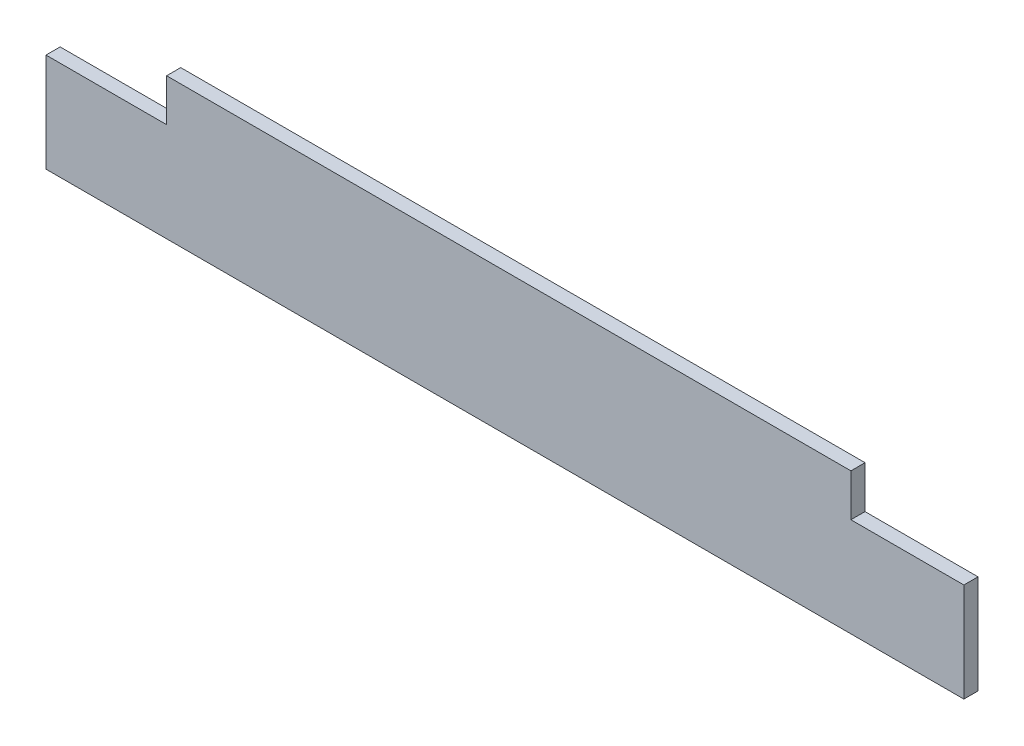
ISO-10303-21;
HEADER;
FILE_DESCRIPTION(('STEP AP214'),'2;1');
FILE_NAME('part.step','',(''),(''),'','','');
FILE_SCHEMA(('AUTOMOTIVE_DESIGN { 1 0 10303 214 1 1 1 1 }'));
ENDSEC;
DATA;
#1=APPLICATION_CONTEXT('core data for automotive mechanical design processes');
#2=APPLICATION_PROTOCOL_DEFINITION('international standard','automotive_design',2000,#1);
#3=PRODUCT_CONTEXT('',#1,'mechanical');
#4=PRODUCT('Part','Part','',(#3));
#5=PRODUCT_RELATED_PRODUCT_CATEGORY('part','',(#4));
#6=PRODUCT_DEFINITION_FORMATION('','',#4);
#7=PRODUCT_DEFINITION_CONTEXT('part definition',#1,'design');
#8=PRODUCT_DEFINITION('design','',#6,#7);
#9=PRODUCT_DEFINITION_SHAPE('','',#8);
#10=(LENGTH_UNIT() NAMED_UNIT(*) SI_UNIT(.MILLI.,.METRE.));
#11=(NAMED_UNIT(*) PLANE_ANGLE_UNIT() SI_UNIT($,.RADIAN.));
#12=(NAMED_UNIT(*) SI_UNIT($,.STERADIAN.) SOLID_ANGLE_UNIT());
#13=UNCERTAINTY_MEASURE_WITH_UNIT(LENGTH_MEASURE(1.E-05),#10,'distance_accuracy_value','');
#14=(GEOMETRIC_REPRESENTATION_CONTEXT(3) GLOBAL_UNCERTAINTY_ASSIGNED_CONTEXT((#13)) GLOBAL_UNIT_ASSIGNED_CONTEXT((#10,
#11,#12)) REPRESENTATION_CONTEXT('',''));
#15=CARTESIAN_POINT('',(0.,0.,0.));
#16=DIRECTION('',(0.,0.,1.));
#17=DIRECTION('',(1.,0.,0.));
#18=AXIS2_PLACEMENT_3D('',#15,#16,#17);
#19=CARTESIAN_POINT('',(245.,0.,10.));
#20=DIRECTION('',(1.,0.,0.));
#21=DIRECTION('',(0.,0.,-1.));
#22=AXIS2_PLACEMENT_3D('',#19,#20,#21);
#23=PLANE('',#22);
#24=DIRECTION('',(0.,-1.,0.));
#25=VECTOR('',#24,1.);
#26=CARTESIAN_POINT('',(245.,0.,0.));
#27=LINE('',#26,#25);
#28=CARTESIAN_POINT('',(245.,-119.452554744526,0.));
#29=VERTEX_POINT('',#28);
#30=CARTESIAN_POINT('',(245.,-149.452554744526,0.));
#31=VERTEX_POINT('',#30);
#32=EDGE_CURVE('E141',#29,#31,#27,.T.);
#33=ORIENTED_EDGE('',*,*,#32,.F.);
#34=DIRECTION('',(0.,0.,-1.));
#35=VECTOR('',#34,1.);
#36=CARTESIAN_POINT('',(245.,-119.452554744526,10.));
#37=LINE('',#36,#35);
#38=CARTESIAN_POINT('',(245.,-119.452554744526,10.));
#39=VERTEX_POINT('',#38);
#40=EDGE_CURVE('E11',#39,#29,#37,.T.);
#41=ORIENTED_EDGE('',*,*,#40,.F.);
#42=DIRECTION('',(0.,-1.,0.));
#43=VECTOR('',#42,1.);
#44=CARTESIAN_POINT('',(245.,0.,10.));
#45=LINE('',#44,#43);
#46=CARTESIAN_POINT('',(245.,-149.452554744526,10.));
#47=VERTEX_POINT('',#46);
#48=EDGE_CURVE('E160',#39,#47,#45,.T.);
#49=ORIENTED_EDGE('',*,*,#48,.T.);
#50=DIRECTION('',(0.,0.,-1.));
#51=VECTOR('',#50,1.);
#52=CARTESIAN_POINT('',(245.,-149.452554744526,10.));
#53=LINE('',#52,#51);
#54=EDGE_CURVE('E100',#47,#31,#53,.T.);
#55=ORIENTED_EDGE('',*,*,#54,.T.);
#56=EDGE_LOOP('',(#33,#41,#49,#55));
#57=FACE_BOUND('',#56,.T.);
#58=ADVANCED_FACE('F49',(#57),#23,.T.);
#59=CARTESIAN_POINT('',(0.,-119.452554744526,10.));
#60=DIRECTION('',(0.,1.,0.));
#61=DIRECTION('',(-1.,0.,0.));
#62=AXIS2_PLACEMENT_3D('',#59,#60,#61);
#63=PLANE('',#62);
#64=DIRECTION('',(1.,0.,0.));
#65=VECTOR('',#64,1.);
#66=CARTESIAN_POINT('',(0.,-119.452554744526,0.));
#67=LINE('',#66,#65);
#68=CARTESIAN_POINT('',(-239.598540145985,-119.452554744526,0.));
#69=VERTEX_POINT('',#68);
#70=EDGE_CURVE('E144',#69,#29,#67,.T.);
#71=ORIENTED_EDGE('',*,*,#70,.F.);
#72=DIRECTION('',(0.,0.,-1.));
#73=VECTOR('',#72,1.);
#74=CARTESIAN_POINT('',(-239.598540145985,-119.452554744526,10.));
#75=LINE('',#74,#73);
#76=CARTESIAN_POINT('',(-239.598540145985,-119.452554744526,10.));
#77=VERTEX_POINT('',#76);
#78=EDGE_CURVE('E57',#77,#69,#75,.T.);
#79=ORIENTED_EDGE('',*,*,#78,.F.);
#80=DIRECTION('',(1.,0.,0.));
#81=VECTOR('',#80,1.);
#82=CARTESIAN_POINT('',(0.,-119.452554744526,10.));
#83=LINE('',#82,#81);
#84=EDGE_CURVE('E181',#77,#39,#83,.T.);
#85=ORIENTED_EDGE('',*,*,#84,.T.);
#86=ORIENTED_EDGE('',*,*,#40,.T.);
#87=EDGE_LOOP('',(#71,#79,#85,#86));
#88=FACE_BOUND('',#87,.T.);
#89=ADVANCED_FACE('F180',(#88),#63,.T.);
#90=CARTESIAN_POINT('',(-239.598540145985,2.21673179947207E-13,10.));
#91=DIRECTION('',(1.,0.,0.));
#92=DIRECTION('',(0.,1.,0.));
#93=AXIS2_PLACEMENT_3D('',#90,#91,#92);
#94=PLANE('',#93);
#95=DIRECTION('',(0.,-1.,0.));
#96=VECTOR('',#95,1.);
#97=CARTESIAN_POINT('',(-239.598540145985,2.21673179947207E-13,0.));
#98=LINE('',#97,#96);
#99=CARTESIAN_POINT('',(-239.598540145986,-149.452554744526,0.));
#100=VERTEX_POINT('',#99);
#101=EDGE_CURVE('E147',#69,#100,#98,.T.);
#102=ORIENTED_EDGE('',*,*,#101,.T.);
#103=DIRECTION('',(0.,0.,-1.));
#104=VECTOR('',#103,1.);
#105=CARTESIAN_POINT('',(-239.598540145986,-149.452554744526,10.));
#106=LINE('',#105,#104);
#107=CARTESIAN_POINT('',(-239.598540145986,-149.452554744526,10.));
#108=VERTEX_POINT('',#107);
#109=EDGE_CURVE('E166',#108,#100,#106,.T.);
#110=ORIENTED_EDGE('',*,*,#109,.F.);
#111=DIRECTION('',(0.,-1.,0.));
#112=VECTOR('',#111,1.);
#113=CARTESIAN_POINT('',(-239.598540145985,2.21673179947207E-13,10.));
#114=LINE('',#113,#112);
#115=EDGE_CURVE('E172',#77,#108,#114,.T.);
#116=ORIENTED_EDGE('',*,*,#115,.F.);
#117=ORIENTED_EDGE('',*,*,#78,.T.);
#118=EDGE_LOOP('',(#102,#110,#116,#117));
#119=FACE_BOUND('',#118,.T.);
#120=ADVANCED_FACE('F170',(#119),#94,.F.);
#121=CARTESIAN_POINT('',(0.,-149.452554744526,10.));
#122=DIRECTION('',(0.,1.,0.));
#123=DIRECTION('',(0.,0.,1.));
#124=AXIS2_PLACEMENT_3D('',#121,#122,#123);
#125=PLANE('',#124);
#126=DIRECTION('',(1.,0.,0.));
#127=VECTOR('',#126,1.);
#128=CARTESIAN_POINT('',(0.,-149.452554744526,0.));
#129=LINE('',#128,#127);
#130=CARTESIAN_POINT('',(-325.,-149.452554744526,0.));
#131=VERTEX_POINT('',#130);
#132=EDGE_CURVE('E150',#131,#100,#129,.T.);
#133=ORIENTED_EDGE('',*,*,#132,.F.);
#134=DIRECTION('',(0.,0.,-1.));
#135=VECTOR('',#134,1.);
#136=CARTESIAN_POINT('',(-325.,-149.452554744526,10.));
#137=LINE('',#136,#135);
#138=CARTESIAN_POINT('',(-325.,-149.452554744526,10.));
#139=VERTEX_POINT('',#138);
#140=EDGE_CURVE('E164',#139,#131,#137,.T.);
#141=ORIENTED_EDGE('',*,*,#140,.F.);
#142=DIRECTION('',(1.,0.,0.));
#143=VECTOR('',#142,1.);
#144=CARTESIAN_POINT('',(0.,-149.452554744526,10.));
#145=LINE('',#144,#143);
#146=EDGE_CURVE('E189',#139,#108,#145,.T.);
#147=ORIENTED_EDGE('',*,*,#146,.T.);
#148=ORIENTED_EDGE('',*,*,#109,.T.);
#149=EDGE_LOOP('',(#133,#141,#147,#148));
#150=FACE_BOUND('',#149,.T.);
#151=ADVANCED_FACE('F195',(#150),#125,.T.);
#152=CARTESIAN_POINT('',(-325.,0.,10.));
#153=DIRECTION('',(-1.,0.,0.));
#154=DIRECTION('',(0.,0.,1.));
#155=AXIS2_PLACEMENT_3D('',#152,#153,#154);
#156=PLANE('',#155);
#157=DIRECTION('',(0.,1.,0.));
#158=VECTOR('',#157,1.);
#159=CARTESIAN_POINT('',(-325.,0.,0.));
#160=LINE('',#159,#158);
#161=CARTESIAN_POINT('',(-325.,-219.452554744526,0.));
#162=VERTEX_POINT('',#161);
#163=EDGE_CURVE('E153',#162,#131,#160,.T.);
#164=ORIENTED_EDGE('',*,*,#163,.F.);
#165=DIRECTION('',(0.,0.,-1.));
#166=VECTOR('',#165,1.);
#167=CARTESIAN_POINT('',(-325.,-219.452554744526,10.));
#168=LINE('',#167,#166);
#169=CARTESIAN_POINT('',(-325.,-219.452554744526,10.));
#170=VERTEX_POINT('',#169);
#171=EDGE_CURVE('E133',#170,#162,#168,.T.);
#172=ORIENTED_EDGE('',*,*,#171,.F.);
#173=DIRECTION('',(0.,1.,0.));
#174=VECTOR('',#173,1.);
#175=CARTESIAN_POINT('',(-325.,0.,10.));
#176=LINE('',#175,#174);
#177=EDGE_CURVE('E126',#170,#139,#176,.T.);
#178=ORIENTED_EDGE('',*,*,#177,.T.);
#179=ORIENTED_EDGE('',*,*,#140,.T.);
#180=EDGE_LOOP('',(#164,#172,#178,#179));
#181=FACE_BOUND('',#180,.T.);
#182=ADVANCED_FACE('F193',(#181),#156,.T.);
#183=CARTESIAN_POINT('',(0.,-219.452554744526,10.));
#184=DIRECTION('',(0.,1.,0.));
#185=DIRECTION('',(-1.,0.,0.));
#186=AXIS2_PLACEMENT_3D('',#183,#184,#185);
#187=PLANE('',#186);
#188=DIRECTION('',(1.,0.,0.));
#189=VECTOR('',#188,1.);
#190=CARTESIAN_POINT('',(0.,-219.452554744526,0.));
#191=LINE('',#190,#189);
#192=CARTESIAN_POINT('',(325.,-219.452554744526,0.));
#193=VERTEX_POINT('',#192);
#194=EDGE_CURVE('E132',#162,#193,#191,.T.);
#195=ORIENTED_EDGE('',*,*,#194,.T.);
#196=DIRECTION('',(0.,0.,-1.));
#197=VECTOR('',#196,1.);
#198=CARTESIAN_POINT('',(325.,-219.452554744526,10.));
#199=LINE('',#198,#197);
#200=CARTESIAN_POINT('',(325.,-219.452554744526,10.));
#201=VERTEX_POINT('',#200);
#202=EDGE_CURVE('E129',#201,#193,#199,.T.);
#203=ORIENTED_EDGE('',*,*,#202,.F.);
#204=DIRECTION('',(1.,0.,0.));
#205=VECTOR('',#204,1.);
#206=CARTESIAN_POINT('',(0.,-219.452554744526,10.));
#207=LINE('',#206,#205);
#208=EDGE_CURVE('E119',#170,#201,#207,.T.);
#209=ORIENTED_EDGE('',*,*,#208,.F.);
#210=ORIENTED_EDGE('',*,*,#171,.T.);
#211=EDGE_LOOP('',(#195,#203,#209,#210));
#212=FACE_BOUND('',#211,.T.);
#213=ADVANCED_FACE('F130',(#212),#187,.F.);
#214=CARTESIAN_POINT('',(325.,0.,10.));
#215=DIRECTION('',(-1.,0.,0.));
#216=DIRECTION('',(0.,0.,1.));
#217=AXIS2_PLACEMENT_3D('',#214,#215,#216);
#218=PLANE('',#217);
#219=DIRECTION('',(0.,1.,0.));
#220=VECTOR('',#219,1.);
#221=CARTESIAN_POINT('',(325.,0.,0.));
#222=LINE('',#221,#220);
#223=CARTESIAN_POINT('',(325.,-149.452554744526,0.));
#224=VERTEX_POINT('',#223);
#225=EDGE_CURVE('E93',#193,#224,#222,.T.);
#226=ORIENTED_EDGE('',*,*,#225,.T.);
#227=DIRECTION('',(0.,0.,-1.));
#228=VECTOR('',#227,1.);
#229=CARTESIAN_POINT('',(325.,-149.452554744526,10.));
#230=LINE('',#229,#228);
#231=CARTESIAN_POINT('',(325.,-149.452554744526,10.));
#232=VERTEX_POINT('',#231);
#233=EDGE_CURVE('E134',#232,#224,#230,.T.);
#234=ORIENTED_EDGE('',*,*,#233,.F.);
#235=DIRECTION('',(0.,1.,0.));
#236=VECTOR('',#235,1.);
#237=CARTESIAN_POINT('',(325.,0.,10.));
#238=LINE('',#237,#236);
#239=EDGE_CURVE('E123',#201,#232,#238,.T.);
#240=ORIENTED_EDGE('',*,*,#239,.F.);
#241=ORIENTED_EDGE('',*,*,#202,.T.);
#242=EDGE_LOOP('',(#226,#234,#240,#241));
#243=FACE_BOUND('',#242,.T.);
#244=ADVANCED_FACE('F136',(#243),#218,.F.);
#245=CARTESIAN_POINT('',(0.,-149.452554744526,10.));
#246=DIRECTION('',(0.,-1.,0.));
#247=DIRECTION('',(0.,0.,-1.));
#248=AXIS2_PLACEMENT_3D('',#245,#246,#247);
#249=PLANE('',#248);
#250=DIRECTION('',(-1.,0.,0.));
#251=VECTOR('',#250,1.);
#252=CARTESIAN_POINT('',(0.,-149.452554744526,0.));
#253=LINE('',#252,#251);
#254=EDGE_CURVE('E158',#224,#31,#253,.T.);
#255=ORIENTED_EDGE('',*,*,#254,.T.);
#256=ORIENTED_EDGE('',*,*,#54,.F.);
#257=DIRECTION('',(-1.,0.,0.));
#258=VECTOR('',#257,1.);
#259=CARTESIAN_POINT('',(0.,-149.452554744526,10.));
#260=LINE('',#259,#258);
#261=EDGE_CURVE('E65',#232,#47,#260,.T.);
#262=ORIENTED_EDGE('',*,*,#261,.F.);
#263=ORIENTED_EDGE('',*,*,#233,.T.);
#264=EDGE_LOOP('',(#255,#256,#262,#263));
#265=FACE_BOUND('',#264,.T.);
#266=ADVANCED_FACE('F184',(#265),#249,.F.);
#267=CARTESIAN_POINT('',(0.,0.,10.));
#268=DIRECTION('',(0.,0.,1.));
#269=DIRECTION('',(1.,0.,0.));
#270=AXIS2_PLACEMENT_3D('',#267,#268,#269);
#271=PLANE('',#270);
#272=ORIENTED_EDGE('',*,*,#48,.F.);
#273=ORIENTED_EDGE('',*,*,#84,.F.);
#274=ORIENTED_EDGE('',*,*,#115,.T.);
#275=ORIENTED_EDGE('',*,*,#146,.F.);
#276=ORIENTED_EDGE('',*,*,#177,.F.);
#277=ORIENTED_EDGE('',*,*,#208,.T.);
#278=ORIENTED_EDGE('',*,*,#239,.T.);
#279=ORIENTED_EDGE('',*,*,#261,.T.);
#280=EDGE_LOOP('',(#272,#273,#274,#275,#276,#277,#278,#279));
#281=FACE_BOUND('',#280,.T.);
#282=ADVANCED_FACE('F121',(#281),#271,.T.);
#283=CARTESIAN_POINT('',(0.,0.,0.));
#284=DIRECTION('',(0.,0.,1.));
#285=DIRECTION('',(1.,0.,0.));
#286=AXIS2_PLACEMENT_3D('',#283,#284,#285);
#287=PLANE('',#286);
#288=ORIENTED_EDGE('',*,*,#32,.T.);
#289=ORIENTED_EDGE('',*,*,#254,.F.);
#290=ORIENTED_EDGE('',*,*,#225,.F.);
#291=ORIENTED_EDGE('',*,*,#194,.F.);
#292=ORIENTED_EDGE('',*,*,#163,.T.);
#293=ORIENTED_EDGE('',*,*,#132,.T.);
#294=ORIENTED_EDGE('',*,*,#101,.F.);
#295=ORIENTED_EDGE('',*,*,#70,.T.);
#296=EDGE_LOOP('',(#288,#289,#290,#291,#292,#293,#294,#295));
#297=FACE_BOUND('',#296,.T.);
#298=ADVANCED_FACE('F178',(#297),#287,.F.);
#299=CLOSED_SHELL('',(#58,#89,#120,#151,#182,#213,#244,#266,#282,#298));
#300=MANIFOLD_SOLID_BREP('B2',#299);
#301=ADVANCED_BREP_SHAPE_REPRESENTATION('',(#18,#300),#14);
#302=SHAPE_DEFINITION_REPRESENTATION(#9,#301);
ENDSEC;
END-ISO-10303-21;
